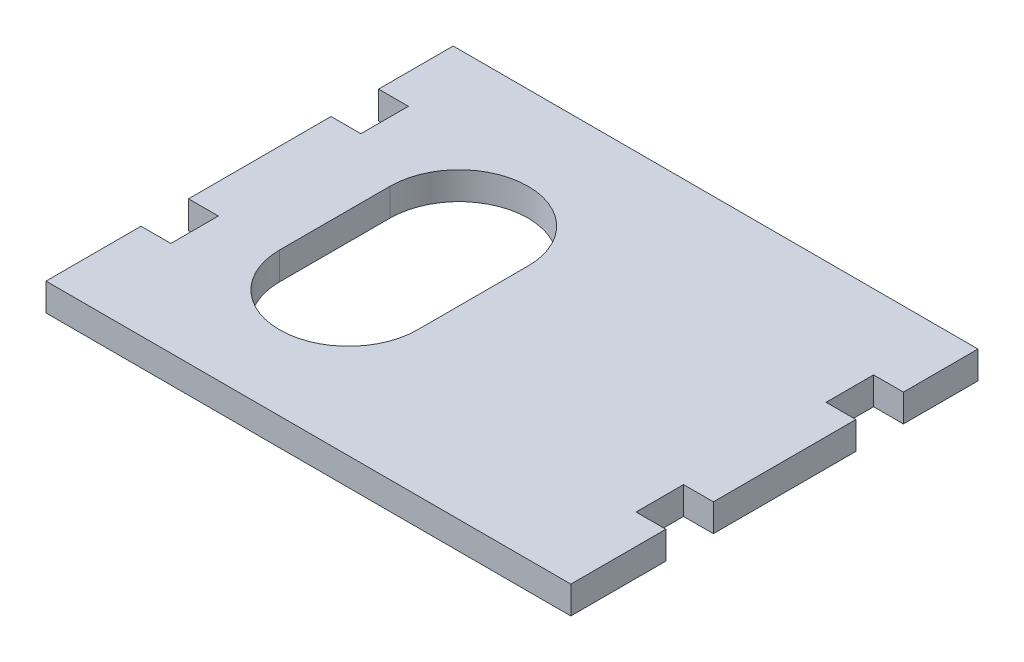
ISO-10303-21;
HEADER;
FILE_DESCRIPTION(('STEP AP214'),'2;1');
FILE_NAME('part.step','',(''),(''),'','','');
FILE_SCHEMA(('AUTOMOTIVE_DESIGN { 1 0 10303 214 1 1 1 1 }'));
ENDSEC;
DATA;
#1=APPLICATION_CONTEXT('core data for automotive mechanical design processes');
#2=APPLICATION_PROTOCOL_DEFINITION('international standard','automotive_design',2000,#1);
#3=PRODUCT_CONTEXT('',#1,'mechanical');
#4=PRODUCT('Part','Part','',(#3));
#5=PRODUCT_RELATED_PRODUCT_CATEGORY('part','',(#4));
#6=PRODUCT_DEFINITION_FORMATION('','',#4);
#7=PRODUCT_DEFINITION_CONTEXT('part definition',#1,'design');
#8=PRODUCT_DEFINITION('design','',#6,#7);
#9=PRODUCT_DEFINITION_SHAPE('','',#8);
#10=(LENGTH_UNIT() NAMED_UNIT(*) SI_UNIT(.MILLI.,.METRE.));
#11=(NAMED_UNIT(*) PLANE_ANGLE_UNIT() SI_UNIT($,.RADIAN.));
#12=(NAMED_UNIT(*) SI_UNIT($,.STERADIAN.) SOLID_ANGLE_UNIT());
#13=UNCERTAINTY_MEASURE_WITH_UNIT(LENGTH_MEASURE(1.E-05),#10,'distance_accuracy_value','');
#14=(GEOMETRIC_REPRESENTATION_CONTEXT(3) GLOBAL_UNCERTAINTY_ASSIGNED_CONTEXT((#13)) GLOBAL_UNIT_ASSIGNED_CONTEXT((#10,
#11,#12)) REPRESENTATION_CONTEXT('',''));
#15=CARTESIAN_POINT('',(0.,0.,0.));
#16=DIRECTION('',(0.,0.,1.));
#17=DIRECTION('',(1.,0.,0.));
#18=AXIS2_PLACEMENT_3D('',#15,#16,#17);
#19=CARTESIAN_POINT('',(50.5504587155964,5.,-24.5126146788991));
#20=DIRECTION('',(1.,0.,0.));
#21=DIRECTION('',(0.,0.,-1.));
#22=AXIS2_PLACEMENT_3D('',#19,#20,#21);
#23=PLANE('',#22);
#24=DIRECTION('',(0.,1.,0.));
#25=VECTOR('',#24,1.);
#26=CARTESIAN_POINT('',(50.5504587155964,-0.00100000000000013,23.3873853211009));
#27=LINE('',#26,#25);
#28=CARTESIAN_POINT('',(50.5504587155964,0.,23.3873853211009));
#29=VERTEX_POINT('',#28);
#30=CARTESIAN_POINT('',(50.5504587155964,5.,23.3873853211009));
#31=VERTEX_POINT('',#30);
#32=EDGE_CURVE('E247',#29,#31,#27,.T.);
#33=ORIENTED_EDGE('',*,*,#32,.F.);
#34=DIRECTION('',(0.,0.,1.));
#35=VECTOR('',#34,1.);
#36=CARTESIAN_POINT('',(50.5504587155964,0.,-24.5126146788991));
#37=LINE('',#36,#35);
#38=CARTESIAN_POINT('',(50.5504587155964,0.,-2.41261467889908));
#39=VERTEX_POINT('',#38);
#40=EDGE_CURVE('E358',#39,#29,#37,.T.);
#41=ORIENTED_EDGE('',*,*,#40,.F.);
#42=DIRECTION('',(0.,1.,0.));
#43=VECTOR('',#42,1.);
#44=CARTESIAN_POINT('',(50.5504587155964,-0.00100000000000013,-2.41261467889908));
#45=LINE('',#44,#43);
#46=CARTESIAN_POINT('',(50.5504587155964,5.,-2.41261467889908));
#47=VERTEX_POINT('',#46);
#48=EDGE_CURVE('E274',#39,#47,#45,.T.);
#49=ORIENTED_EDGE('',*,*,#48,.T.);
#50=DIRECTION('',(0.,0.,1.));
#51=VECTOR('',#50,1.);
#52=CARTESIAN_POINT('',(50.5504587155964,5.,-24.5126146788991));
#53=LINE('',#52,#51);
#54=EDGE_CURVE('E342',#47,#31,#53,.T.);
#55=ORIENTED_EDGE('',*,*,#54,.T.);
#56=EDGE_LOOP('',(#33,#41,#49,#55));
#57=FACE_BOUND('',#56,.T.);
#58=ADVANCED_FACE('F33',(#57),#23,.T.);
#59=DIRECTION('',(0.,1.,0.));
#60=VECTOR('',#59,1.);
#61=CARTESIAN_POINT('',(50.5504587155964,-0.00100000000000013,-11.0126146788991));
#62=LINE('',#61,#60);
#63=CARTESIAN_POINT('',(50.5504587155964,0.,-11.0126146788991));
#64=VERTEX_POINT('',#63);
#65=CARTESIAN_POINT('',(50.5504587155964,5.,-11.0126146788991));
#66=VERTEX_POINT('',#65);
#67=EDGE_CURVE('E272',#64,#66,#62,.T.);
#68=ORIENTED_EDGE('',*,*,#67,.F.);
#69=CARTESIAN_POINT('',(50.5504587155964,0.,-24.5126146788991));
#70=VERTEX_POINT('',#69);
#71=EDGE_CURVE('E354',#70,#64,#37,.T.);
#72=ORIENTED_EDGE('',*,*,#71,.F.);
#73=DIRECTION('',(0.,-1.,0.));
#74=VECTOR('',#73,1.);
#75=CARTESIAN_POINT('',(50.5504587155964,5.,-24.5126146788991));
#76=LINE('',#75,#74);
#77=CARTESIAN_POINT('',(50.5504587155964,5.,-24.5126146788991));
#78=VERTEX_POINT('',#77);
#79=EDGE_CURVE('E362',#78,#70,#76,.T.);
#80=ORIENTED_EDGE('',*,*,#79,.F.);
#81=EDGE_CURVE('E338',#78,#66,#53,.T.);
#82=ORIENTED_EDGE('',*,*,#81,.T.);
#83=EDGE_LOOP('',(#68,#72,#80,#82));
#84=FACE_BOUND('',#83,.T.);
#85=ADVANCED_FACE('F440',(#84),#23,.T.);
#86=CARTESIAN_POINT('',(-44.4495412844036,5.,-24.5126146788991));
#87=DIRECTION('',(1.,0.,0.));
#88=DIRECTION('',(0.,0.,-1.));
#89=AXIS2_PLACEMENT_3D('',#86,#87,#88);
#90=PLANE('',#89);
#91=DIRECTION('',(0.,0.,1.));
#92=VECTOR('',#91,1.);
#93=CARTESIAN_POINT('',(-44.4495412844036,0.,-24.5126146788991));
#94=LINE('',#93,#92);
#95=CARTESIAN_POINT('',(-44.4495412844036,0.,-2.41261467889908));
#96=VERTEX_POINT('',#95);
#97=CARTESIAN_POINT('',(-44.4495412844036,0.,23.3873853211009));
#98=VERTEX_POINT('',#97);
#99=EDGE_CURVE('E350',#96,#98,#94,.T.);
#100=ORIENTED_EDGE('',*,*,#99,.T.);
#101=DIRECTION('',(0.,1.,0.));
#102=VECTOR('',#101,1.);
#103=CARTESIAN_POINT('',(-44.4495412844036,-0.00100000000000013,23.3873853211009));
#104=LINE('',#103,#102);
#105=CARTESIAN_POINT('',(-44.4495412844036,5.,23.3873853211009));
#106=VERTEX_POINT('',#105);
#107=EDGE_CURVE('E294',#98,#106,#104,.T.);
#108=ORIENTED_EDGE('',*,*,#107,.T.);
#109=DIRECTION('',(0.,0.,1.));
#110=VECTOR('',#109,1.);
#111=CARTESIAN_POINT('',(-44.4495412844036,5.,-24.5126146788991));
#112=LINE('',#111,#110);
#113=CARTESIAN_POINT('',(-44.4495412844036,5.,-2.41261467889908));
#114=VERTEX_POINT('',#113);
#115=EDGE_CURVE('E333',#114,#106,#112,.T.);
#116=ORIENTED_EDGE('',*,*,#115,.F.);
#117=DIRECTION('',(0.,1.,0.));
#118=VECTOR('',#117,1.);
#119=CARTESIAN_POINT('',(-44.4495412844036,-0.00100000000000013,-2.41261467889908));
#120=LINE('',#119,#118);
#121=EDGE_CURVE('E317',#96,#114,#120,.T.);
#122=ORIENTED_EDGE('',*,*,#121,.F.);
#123=EDGE_LOOP('',(#100,#108,#116,#122));
#124=FACE_BOUND('',#123,.T.);
#125=ADVANCED_FACE('F407',(#124),#90,.F.);
#126=CARTESIAN_POINT('',(-44.4495412844036,0.,-24.5126146788991));
#127=VERTEX_POINT('',#126);
#128=CARTESIAN_POINT('',(-44.4495412844036,0.,-11.0126146788991));
#129=VERTEX_POINT('',#128);
#130=EDGE_CURVE('E346',#127,#129,#94,.T.);
#131=ORIENTED_EDGE('',*,*,#130,.T.);
#132=DIRECTION('',(0.,1.,0.));
#133=VECTOR('',#132,1.);
#134=CARTESIAN_POINT('',(-44.4495412844036,-0.00100000000000013,-11.0126146788991));
#135=LINE('',#134,#133);
#136=CARTESIAN_POINT('',(-44.4495412844036,5.,-11.0126146788991));
#137=VERTEX_POINT('',#136);
#138=EDGE_CURVE('E318',#129,#137,#135,.T.);
#139=ORIENTED_EDGE('',*,*,#138,.T.);
#140=CARTESIAN_POINT('',(-44.4495412844036,5.,-24.5126146788991));
#141=VERTEX_POINT('',#140);
#142=EDGE_CURVE('E329',#141,#137,#112,.T.);
#143=ORIENTED_EDGE('',*,*,#142,.F.);
#144=DIRECTION('',(0.,-1.,0.));
#145=VECTOR('',#144,1.);
#146=CARTESIAN_POINT('',(-44.4495412844036,5.,-24.5126146788991));
#147=LINE('',#146,#145);
#148=EDGE_CURVE('E345',#141,#127,#147,.T.);
#149=ORIENTED_EDGE('',*,*,#148,.T.);
#150=EDGE_LOOP('',(#131,#139,#143,#149));
#151=FACE_BOUND('',#150,.T.);
#152=ADVANCED_FACE('F431',(#151),#90,.F.);
#153=CARTESIAN_POINT('',(-44.4495412844036,5.,31.9873853211009));
#154=VERTEX_POINT('',#153);
#155=CARTESIAN_POINT('',(-44.4495412844036,5.,49.1873853211009));
#156=VERTEX_POINT('',#155);
#157=EDGE_CURVE('E334',#154,#156,#112,.T.);
#158=ORIENTED_EDGE('',*,*,#157,.F.);
#159=DIRECTION('',(0.,1.,0.));
#160=VECTOR('',#159,1.);
#161=CARTESIAN_POINT('',(-44.4495412844036,-0.00100000000000013,31.9873853211009));
#162=LINE('',#161,#160);
#163=CARTESIAN_POINT('',(-44.4495412844036,0.,31.9873853211009));
#164=VERTEX_POINT('',#163);
#165=EDGE_CURVE('E293',#164,#154,#162,.T.);
#166=ORIENTED_EDGE('',*,*,#165,.F.);
#167=CARTESIAN_POINT('',(-44.4495412844036,0.,49.1873853211009));
#168=VERTEX_POINT('',#167);
#169=EDGE_CURVE('E328',#164,#168,#94,.T.);
#170=ORIENTED_EDGE('',*,*,#169,.T.);
#171=DIRECTION('',(0.,-1.,0.));
#172=VECTOR('',#171,1.);
#173=CARTESIAN_POINT('',(-44.4495412844036,5.,49.1873853211009));
#174=LINE('',#173,#172);
#175=EDGE_CURVE('E11',#156,#168,#174,.T.);
#176=ORIENTED_EDGE('',*,*,#175,.F.);
#177=EDGE_LOOP('',(#158,#166,#170,#176));
#178=FACE_BOUND('',#177,.T.);
#179=ADVANCED_FACE('F35',(#178),#90,.F.);
#180=CARTESIAN_POINT('',(-44.4495412844036,5.,49.1873853211009));
#181=DIRECTION('',(0.,0.,-1.));
#182=DIRECTION('',(-1.,0.,0.));
#183=AXIS2_PLACEMENT_3D('',#180,#181,#182);
#184=PLANE('',#183);
#185=DIRECTION('',(1.,0.,0.));
#186=VECTOR('',#185,1.);
#187=CARTESIAN_POINT('',(-44.4495412844036,0.,49.1873853211009));
#188=LINE('',#187,#186);
#189=CARTESIAN_POINT('',(50.5504587155964,0.,49.1873853211009));
#190=VERTEX_POINT('',#189);
#191=EDGE_CURVE('E349',#168,#190,#188,.T.);
#192=ORIENTED_EDGE('',*,*,#191,.T.);
#193=DIRECTION('',(0.,-1.,0.));
#194=VECTOR('',#193,1.);
#195=CARTESIAN_POINT('',(50.5504587155964,5.,49.1873853211009));
#196=LINE('',#195,#194);
#197=CARTESIAN_POINT('',(50.5504587155964,5.,49.1873853211009));
#198=VERTEX_POINT('',#197);
#199=EDGE_CURVE('E41',#198,#190,#196,.T.);
#200=ORIENTED_EDGE('',*,*,#199,.F.);
#201=DIRECTION('',(1.,0.,0.));
#202=VECTOR('',#201,1.);
#203=CARTESIAN_POINT('',(-44.4495412844036,5.,49.1873853211009));
#204=LINE('',#203,#202);
#205=EDGE_CURVE('E332',#156,#198,#204,.T.);
#206=ORIENTED_EDGE('',*,*,#205,.F.);
#207=ORIENTED_EDGE('',*,*,#175,.T.);
#208=EDGE_LOOP('',(#192,#200,#206,#207));
#209=FACE_BOUND('',#208,.T.);
#210=ADVANCED_FACE('F372',(#209),#184,.F.);
#211=DIRECTION('',(0.,1.,0.));
#212=VECTOR('',#211,1.);
#213=CARTESIAN_POINT('',(50.5504587155964,-0.00100000000000013,31.9873853211009));
#214=LINE('',#213,#212);
#215=CARTESIAN_POINT('',(50.5504587155964,0.,31.9873853211009));
#216=VERTEX_POINT('',#215);
#217=CARTESIAN_POINT('',(50.5504587155964,5.,31.9873853211009));
#218=VERTEX_POINT('',#217);
#219=EDGE_CURVE('E249',#216,#218,#214,.T.);
#220=ORIENTED_EDGE('',*,*,#219,.T.);
#221=EDGE_CURVE('E337',#218,#198,#53,.T.);
#222=ORIENTED_EDGE('',*,*,#221,.T.);
#223=ORIENTED_EDGE('',*,*,#199,.T.);
#224=EDGE_CURVE('E353',#216,#190,#37,.T.);
#225=ORIENTED_EDGE('',*,*,#224,.F.);
#226=EDGE_LOOP('',(#220,#222,#223,#225));
#227=FACE_BOUND('',#226,.T.);
#228=ADVANCED_FACE('F367',(#227),#23,.T.);
#229=CARTESIAN_POINT('',(-44.4495412844036,5.,-24.5126146788991));
#230=DIRECTION('',(0.,0.,-1.));
#231=DIRECTION('',(-1.,0.,0.));
#232=AXIS2_PLACEMENT_3D('',#229,#230,#231);
#233=PLANE('',#232);
#234=DIRECTION('',(1.,0.,0.));
#235=VECTOR('',#234,1.);
#236=CARTESIAN_POINT('',(-44.4495412844036,0.,-24.5126146788991));
#237=LINE('',#236,#235);
#238=EDGE_CURVE('E357',#127,#70,#237,.T.);
#239=ORIENTED_EDGE('',*,*,#238,.F.);
#240=ORIENTED_EDGE('',*,*,#148,.F.);
#241=DIRECTION('',(1.,0.,0.));
#242=VECTOR('',#241,1.);
#243=CARTESIAN_POINT('',(-44.4495412844036,5.,-24.5126146788991));
#244=LINE('',#243,#242);
#245=EDGE_CURVE('E341',#141,#78,#244,.T.);
#246=ORIENTED_EDGE('',*,*,#245,.T.);
#247=ORIENTED_EDGE('',*,*,#79,.T.);
#248=EDGE_LOOP('',(#239,#240,#246,#247));
#249=FACE_BOUND('',#248,.T.);
#250=ADVANCED_FACE('F435',(#249),#233,.T.);
#251=CARTESIAN_POINT('',(0.,5.,0.));
#252=DIRECTION('',(0.,1.,0.));
#253=DIRECTION('',(0.,0.,1.));
#254=AXIS2_PLACEMENT_3D('',#251,#252,#253);
#255=PLANE('',#254);
#256=CARTESIAN_POINT('',(-15.6856392467051,5.,3.18853871329906));
#257=DIRECTION('',(0.,1.,0.));
#258=DIRECTION('',(0.,0.,1.));
#259=AXIS2_PLACEMENT_3D('',#256,#257,#258);
#260=CIRCLE('',#259,12.5);
#261=CARTESIAN_POINT('',(-3.18563924670511,5.,3.18853871329906));
#262=VERTEX_POINT('',#261);
#263=CARTESIAN_POINT('',(-28.1856392467051,5.,3.18853871329906));
#264=VERTEX_POINT('',#263);
#265=EDGE_CURVE('E48',#262,#264,#260,.T.);
#266=ORIENTED_EDGE('',*,*,#265,.F.);
#267=DIRECTION('',(0.,0.,-1.));
#268=VECTOR('',#267,1.);
#269=CARTESIAN_POINT('',(-3.18563924670511,5.,3.18853871329906));
#270=LINE('',#269,#268);
#271=CARTESIAN_POINT('',(-3.18563924670511,5.,23.1885387132991));
#272=VERTEX_POINT('',#271);
#273=EDGE_CURVE('E202',#272,#262,#270,.T.);
#274=ORIENTED_EDGE('',*,*,#273,.F.);
#275=CARTESIAN_POINT('',(-15.6856392467051,5.,23.1885387132991));
#276=DIRECTION('',(0.,1.,0.));
#277=DIRECTION('',(0.,0.,1.));
#278=AXIS2_PLACEMENT_3D('',#275,#276,#277);
#279=CIRCLE('',#278,12.5);
#280=CARTESIAN_POINT('',(-28.1856392467051,5.,23.1885387132991));
#281=VERTEX_POINT('',#280);
#282=EDGE_CURVE('E222',#281,#272,#279,.T.);
#283=ORIENTED_EDGE('',*,*,#282,.F.);
#284=DIRECTION('',(0.,0.,1.));
#285=VECTOR('',#284,1.);
#286=CARTESIAN_POINT('',(-28.1856392467051,5.,3.18853871329906));
#287=LINE('',#286,#285);
#288=EDGE_CURVE('E216',#264,#281,#287,.T.);
#289=ORIENTED_EDGE('',*,*,#288,.F.);
#290=EDGE_LOOP('',(#266,#274,#283,#289));
#291=FACE_BOUND('',#290,.T.);
#292=DIRECTION('',(-1.,0.,0.));
#293=VECTOR('',#292,1.);
#294=CARTESIAN_POINT('',(45.1504587155964,5.,23.3873853211009));
#295=LINE('',#294,#293);
#296=CARTESIAN_POINT('',(45.1504587155964,5.,23.3873853211009));
#297=VERTEX_POINT('',#296);
#298=EDGE_CURVE('E240',#31,#297,#295,.T.);
#299=ORIENTED_EDGE('',*,*,#298,.F.);
#300=ORIENTED_EDGE('',*,*,#54,.F.);
#301=DIRECTION('',(1.,0.,0.));
#302=VECTOR('',#301,1.);
#303=CARTESIAN_POINT('',(45.1504587155964,5.,-2.41261467889908));
#304=LINE('',#303,#302);
#305=CARTESIAN_POINT('',(45.1504587155964,5.,-2.41261467889908));
#306=VERTEX_POINT('',#305);
#307=EDGE_CURVE('E263',#306,#47,#304,.T.);
#308=ORIENTED_EDGE('',*,*,#307,.F.);
#309=DIRECTION('',(0.,0.,1.));
#310=VECTOR('',#309,1.);
#311=CARTESIAN_POINT('',(45.1504587155964,5.,-11.0126146788991));
#312=LINE('',#311,#310);
#313=CARTESIAN_POINT('',(45.1504587155964,5.,-11.0126146788991));
#314=VERTEX_POINT('',#313);
#315=EDGE_CURVE('E260',#314,#306,#312,.T.);
#316=ORIENTED_EDGE('',*,*,#315,.F.);
#317=DIRECTION('',(-1.,0.,0.));
#318=VECTOR('',#317,1.);
#319=CARTESIAN_POINT('',(45.1504587155964,5.,-11.0126146788991));
#320=LINE('',#319,#318);
#321=EDGE_CURVE('E265',#66,#314,#320,.T.);
#322=ORIENTED_EDGE('',*,*,#321,.F.);
#323=ORIENTED_EDGE('',*,*,#81,.F.);
#324=ORIENTED_EDGE('',*,*,#245,.F.);
#325=ORIENTED_EDGE('',*,*,#142,.T.);
#326=DIRECTION('',(-1.,0.,0.));
#327=VECTOR('',#326,1.);
#328=CARTESIAN_POINT('',(-44.4495412844036,5.,-11.0126146788991));
#329=LINE('',#328,#327);
#330=CARTESIAN_POINT('',(-39.0495412844036,5.,-11.0126146788991));
#331=VERTEX_POINT('',#330);
#332=EDGE_CURVE('E315',#331,#137,#329,.T.);
#333=ORIENTED_EDGE('',*,*,#332,.F.);
#334=DIRECTION('',(0.,0.,-1.));
#335=VECTOR('',#334,1.);
#336=CARTESIAN_POINT('',(-39.0495412844036,5.,-11.0126146788991));
#337=LINE('',#336,#335);
#338=CARTESIAN_POINT('',(-39.0495412844036,5.,-2.41261467889908));
#339=VERTEX_POINT('',#338);
#340=EDGE_CURVE('E312',#339,#331,#337,.T.);
#341=ORIENTED_EDGE('',*,*,#340,.F.);
#342=DIRECTION('',(1.,0.,0.));
#343=VECTOR('',#342,1.);
#344=CARTESIAN_POINT('',(-44.4495412844036,5.,-2.41261467889908));
#345=LINE('',#344,#343);
#346=EDGE_CURVE('E309',#114,#339,#345,.T.);
#347=ORIENTED_EDGE('',*,*,#346,.F.);
#348=ORIENTED_EDGE('',*,*,#115,.T.);
#349=DIRECTION('',(-1.,0.,0.));
#350=VECTOR('',#349,1.);
#351=CARTESIAN_POINT('',(-44.4495412844036,5.,23.3873853211009));
#352=LINE('',#351,#350);
#353=CARTESIAN_POINT('',(-39.0495412844036,5.,23.3873853211009));
#354=VERTEX_POINT('',#353);
#355=EDGE_CURVE('E291',#354,#106,#352,.T.);
#356=ORIENTED_EDGE('',*,*,#355,.F.);
#357=DIRECTION('',(0.,0.,-1.));
#358=VECTOR('',#357,1.);
#359=CARTESIAN_POINT('',(-39.0495412844036,5.,23.3873853211009));
#360=LINE('',#359,#358);
#361=CARTESIAN_POINT('',(-39.0495412844036,5.,31.9873853211009));
#362=VERTEX_POINT('',#361);
#363=EDGE_CURVE('E288',#362,#354,#360,.T.);
#364=ORIENTED_EDGE('',*,*,#363,.F.);
#365=DIRECTION('',(1.,0.,0.));
#366=VECTOR('',#365,1.);
#367=CARTESIAN_POINT('',(-44.4495412844036,5.,31.9873853211009));
#368=LINE('',#367,#366);
#369=EDGE_CURVE('E285',#154,#362,#368,.T.);
#370=ORIENTED_EDGE('',*,*,#369,.F.);
#371=ORIENTED_EDGE('',*,*,#157,.T.);
#372=ORIENTED_EDGE('',*,*,#205,.T.);
#373=ORIENTED_EDGE('',*,*,#221,.F.);
#374=DIRECTION('',(1.,0.,0.));
#375=VECTOR('',#374,1.);
#376=CARTESIAN_POINT('',(45.1504587155964,5.,31.9873853211009));
#377=LINE('',#376,#375);
#378=CARTESIAN_POINT('',(45.1504587155964,5.,31.9873853211009));
#379=VERTEX_POINT('',#378);
#380=EDGE_CURVE('E238',#379,#218,#377,.T.);
#381=ORIENTED_EDGE('',*,*,#380,.F.);
#382=DIRECTION('',(0.,0.,1.));
#383=VECTOR('',#382,1.);
#384=CARTESIAN_POINT('',(45.1504587155964,5.,23.3873853211009));
#385=LINE('',#384,#383);
#386=EDGE_CURVE('E235',#297,#379,#385,.T.);
#387=ORIENTED_EDGE('',*,*,#386,.F.);
#388=EDGE_LOOP('',(#299,#300,#308,#316,#322,#323,#324,#325,#333,#341,#347,#348,#356,#364,#370,
#371,#372,#373,#381,#387));
#389=FACE_BOUND('',#388,.T.);
#390=ADVANCED_FACE('F392',(#291,#389),#255,.T.);
#391=CARTESIAN_POINT('',(0.,0.,0.));
#392=DIRECTION('',(0.,1.,0.));
#393=DIRECTION('',(0.,0.,1.));
#394=AXIS2_PLACEMENT_3D('',#391,#392,#393);
#395=PLANE('',#394);
#396=DIRECTION('',(0.,0.,1.));
#397=VECTOR('',#396,1.);
#398=CARTESIAN_POINT('',(-3.18563924670511,0.,3.18853871329906));
#399=LINE('',#398,#397);
#400=CARTESIAN_POINT('',(-3.18563924670511,0.,3.18853871329906));
#401=VERTEX_POINT('',#400);
#402=CARTESIAN_POINT('',(-3.18563924670511,0.,23.1885387132991));
#403=VERTEX_POINT('',#402);
#404=EDGE_CURVE('E214',#401,#403,#399,.T.);
#405=ORIENTED_EDGE('',*,*,#404,.F.);
#406=CARTESIAN_POINT('',(-15.6856392467051,0.,3.18853871329906));
#407=DIRECTION('',(0.,1.,0.));
#408=DIRECTION('',(0.,0.,1.));
#409=AXIS2_PLACEMENT_3D('',#406,#407,#408);
#410=CIRCLE('',#409,12.5);
#411=CARTESIAN_POINT('',(-28.1856392467051,0.,3.18853871329906));
#412=VERTEX_POINT('',#411);
#413=EDGE_CURVE('E196',#412,#401,#410,.F.);
#414=ORIENTED_EDGE('',*,*,#413,.F.);
#415=DIRECTION('',(0.,0.,-1.));
#416=VECTOR('',#415,1.);
#417=CARTESIAN_POINT('',(-28.1856392467051,0.,3.18853871329906));
#418=LINE('',#417,#416);
#419=CARTESIAN_POINT('',(-28.1856392467051,0.,23.1885387132991));
#420=VERTEX_POINT('',#419);
#421=EDGE_CURVE('E205',#420,#412,#418,.T.);
#422=ORIENTED_EDGE('',*,*,#421,.F.);
#423=CARTESIAN_POINT('',(-15.6856392467051,0.,23.1885387132991));
#424=DIRECTION('',(0.,1.,0.));
#425=DIRECTION('',(0.,0.,1.));
#426=AXIS2_PLACEMENT_3D('',#423,#424,#425);
#427=CIRCLE('',#426,12.5);
#428=EDGE_CURVE('E56',#403,#420,#427,.F.);
#429=ORIENTED_EDGE('',*,*,#428,.F.);
#430=EDGE_LOOP('',(#405,#414,#422,#429));
#431=FACE_BOUND('',#430,.T.);
#432=ORIENTED_EDGE('',*,*,#40,.T.);
#433=DIRECTION('',(1.,0.,0.));
#434=VECTOR('',#433,1.);
#435=CARTESIAN_POINT('',(45.1504587155964,0.,23.3873853211009));
#436=LINE('',#435,#434);
#437=CARTESIAN_POINT('',(45.1504587155964,0.,23.3873853211009));
#438=VERTEX_POINT('',#437);
#439=EDGE_CURVE('E233',#438,#29,#436,.T.);
#440=ORIENTED_EDGE('',*,*,#439,.F.);
#441=DIRECTION('',(0.,0.,-1.));
#442=VECTOR('',#441,1.);
#443=CARTESIAN_POINT('',(45.1504587155964,0.,23.3873853211009));
#444=LINE('',#443,#442);
#445=CARTESIAN_POINT('',(45.1504587155964,0.,31.9873853211009));
#446=VERTEX_POINT('',#445);
#447=EDGE_CURVE('E208',#446,#438,#444,.T.);
#448=ORIENTED_EDGE('',*,*,#447,.F.);
#449=DIRECTION('',(-1.,0.,0.));
#450=VECTOR('',#449,1.);
#451=CARTESIAN_POINT('',(45.1504587155964,0.,31.9873853211009));
#452=LINE('',#451,#450);
#453=EDGE_CURVE('E246',#216,#446,#452,.T.);
#454=ORIENTED_EDGE('',*,*,#453,.F.);
#455=ORIENTED_EDGE('',*,*,#224,.T.);
#456=ORIENTED_EDGE('',*,*,#191,.F.);
#457=ORIENTED_EDGE('',*,*,#169,.F.);
#458=DIRECTION('',(-1.,0.,0.));
#459=VECTOR('',#458,1.);
#460=CARTESIAN_POINT('',(-44.4495412844036,0.,31.9873853211009));
#461=LINE('',#460,#459);
#462=CARTESIAN_POINT('',(-39.0495412844036,0.,31.9873853211009));
#463=VERTEX_POINT('',#462);
#464=EDGE_CURVE('E297',#463,#164,#461,.T.);
#465=ORIENTED_EDGE('',*,*,#464,.F.);
#466=DIRECTION('',(0.,0.,1.));
#467=VECTOR('',#466,1.);
#468=CARTESIAN_POINT('',(-39.0495412844036,0.,23.3873853211009));
#469=LINE('',#468,#467);
#470=CARTESIAN_POINT('',(-39.0495412844036,0.,23.3873853211009));
#471=VERTEX_POINT('',#470);
#472=EDGE_CURVE('E280',#471,#463,#469,.T.);
#473=ORIENTED_EDGE('',*,*,#472,.F.);
#474=DIRECTION('',(1.,0.,0.));
#475=VECTOR('',#474,1.);
#476=CARTESIAN_POINT('',(-44.4495412844036,0.,23.3873853211009));
#477=LINE('',#476,#475);
#478=EDGE_CURVE('E282',#98,#471,#477,.T.);
#479=ORIENTED_EDGE('',*,*,#478,.F.);
#480=ORIENTED_EDGE('',*,*,#99,.F.);
#481=DIRECTION('',(-1.,0.,0.));
#482=VECTOR('',#481,1.);
#483=CARTESIAN_POINT('',(-44.4495412844036,0.,-2.41261467889908));
#484=LINE('',#483,#482);
#485=CARTESIAN_POINT('',(-39.0495412844036,0.,-2.41261467889908));
#486=VERTEX_POINT('',#485);
#487=EDGE_CURVE('E321',#486,#96,#484,.T.);
#488=ORIENTED_EDGE('',*,*,#487,.F.);
#489=DIRECTION('',(0.,0.,1.));
#490=VECTOR('',#489,1.);
#491=CARTESIAN_POINT('',(-39.0495412844036,0.,-11.0126146788991));
#492=LINE('',#491,#490);
#493=CARTESIAN_POINT('',(-39.0495412844036,0.,-11.0126146788991));
#494=VERTEX_POINT('',#493);
#495=EDGE_CURVE('E304',#494,#486,#492,.T.);
#496=ORIENTED_EDGE('',*,*,#495,.F.);
#497=DIRECTION('',(1.,0.,0.));
#498=VECTOR('',#497,1.);
#499=CARTESIAN_POINT('',(-44.4495412844036,0.,-11.0126146788991));
#500=LINE('',#499,#498);
#501=EDGE_CURVE('E306',#129,#494,#500,.T.);
#502=ORIENTED_EDGE('',*,*,#501,.F.);
#503=ORIENTED_EDGE('',*,*,#130,.F.);
#504=ORIENTED_EDGE('',*,*,#238,.T.);
#505=ORIENTED_EDGE('',*,*,#71,.T.);
#506=DIRECTION('',(1.,0.,0.));
#507=VECTOR('',#506,1.);
#508=CARTESIAN_POINT('',(45.1504587155964,0.,-11.0126146788991));
#509=LINE('',#508,#507);
#510=CARTESIAN_POINT('',(45.1504587155964,0.,-11.0126146788991));
#511=VERTEX_POINT('',#510);
#512=EDGE_CURVE('E258',#511,#64,#509,.T.);
#513=ORIENTED_EDGE('',*,*,#512,.F.);
#514=DIRECTION('',(0.,0.,-1.));
#515=VECTOR('',#514,1.);
#516=CARTESIAN_POINT('',(45.1504587155964,0.,-11.0126146788991));
#517=LINE('',#516,#515);
#518=CARTESIAN_POINT('',(45.1504587155964,0.,-2.41261467889908));
#519=VERTEX_POINT('',#518);
#520=EDGE_CURVE('E255',#519,#511,#517,.T.);
#521=ORIENTED_EDGE('',*,*,#520,.F.);
#522=DIRECTION('',(-1.,0.,0.));
#523=VECTOR('',#522,1.);
#524=CARTESIAN_POINT('',(45.1504587155964,0.,-2.41261467889908));
#525=LINE('',#524,#523);
#526=EDGE_CURVE('E271',#39,#519,#525,.T.);
#527=ORIENTED_EDGE('',*,*,#526,.F.);
#528=EDGE_LOOP('',(#432,#440,#448,#454,#455,#456,#457,#465,#473,#479,#480,#488,#496,#502,#503,
#504,#505,#513,#521,#527));
#529=FACE_BOUND('',#528,.T.);
#530=ADVANCED_FACE('F211',(#431,#529),#395,.F.);
#531=CARTESIAN_POINT('',(-44.4495412844036,-0.00100000000000013,-11.0126146788991));
#532=DIRECTION('',(0.,0.,-1.));
#533=DIRECTION('',(-1.,0.,0.));
#534=AXIS2_PLACEMENT_3D('',#531,#532,#533);
#535=PLANE('',#534);
#536=ORIENTED_EDGE('',*,*,#501,.T.);
#537=DIRECTION('',(0.,1.,0.));
#538=VECTOR('',#537,1.);
#539=CARTESIAN_POINT('',(-39.0495412844036,-0.00100000000000013,-11.0126146788991));
#540=LINE('',#539,#538);
#541=EDGE_CURVE('E322',#494,#331,#540,.T.);
#542=ORIENTED_EDGE('',*,*,#541,.T.);
#543=ORIENTED_EDGE('',*,*,#332,.T.);
#544=ORIENTED_EDGE('',*,*,#138,.F.);
#545=EDGE_LOOP('',(#536,#542,#543,#544));
#546=FACE_BOUND('',#545,.T.);
#547=ADVANCED_FACE('F498',(#546),#535,.F.);
#548=CARTESIAN_POINT('',(-39.0495412844036,-0.00100000000000013,-11.0126146788991));
#549=DIRECTION('',(1.,0.,0.));
#550=DIRECTION('',(0.,0.,-1.));
#551=AXIS2_PLACEMENT_3D('',#548,#549,#550);
#552=PLANE('',#551);
#553=ORIENTED_EDGE('',*,*,#495,.T.);
#554=DIRECTION('',(0.,1.,0.));
#555=VECTOR('',#554,1.);
#556=CARTESIAN_POINT('',(-39.0495412844036,-0.00100000000000013,-2.41261467889908));
#557=LINE('',#556,#555);
#558=EDGE_CURVE('E324',#486,#339,#557,.T.);
#559=ORIENTED_EDGE('',*,*,#558,.T.);
#560=ORIENTED_EDGE('',*,*,#340,.T.);
#561=ORIENTED_EDGE('',*,*,#541,.F.);
#562=EDGE_LOOP('',(#553,#559,#560,#561));
#563=FACE_BOUND('',#562,.T.);
#564=ADVANCED_FACE('F425',(#563),#552,.F.);
#565=CARTESIAN_POINT('',(-44.4495412844036,-0.00100000000000013,-2.41261467889908));
#566=DIRECTION('',(0.,0.,1.));
#567=DIRECTION('',(1.,0.,0.));
#568=AXIS2_PLACEMENT_3D('',#565,#566,#567);
#569=PLANE('',#568);
#570=ORIENTED_EDGE('',*,*,#487,.T.);
#571=ORIENTED_EDGE('',*,*,#121,.T.);
#572=ORIENTED_EDGE('',*,*,#346,.T.);
#573=ORIENTED_EDGE('',*,*,#558,.F.);
#574=EDGE_LOOP('',(#570,#571,#572,#573));
#575=FACE_BOUND('',#574,.T.);
#576=ADVANCED_FACE('F423',(#575),#569,.F.);
#577=CARTESIAN_POINT('',(-44.4495412844036,-0.00100000000000013,23.3873853211009));
#578=DIRECTION('',(0.,0.,-1.));
#579=DIRECTION('',(-1.,0.,0.));
#580=AXIS2_PLACEMENT_3D('',#577,#578,#579);
#581=PLANE('',#580);
#582=ORIENTED_EDGE('',*,*,#478,.T.);
#583=DIRECTION('',(0.,1.,0.));
#584=VECTOR('',#583,1.);
#585=CARTESIAN_POINT('',(-39.0495412844036,-0.00100000000000013,23.3873853211009));
#586=LINE('',#585,#584);
#587=EDGE_CURVE('E298',#471,#354,#586,.T.);
#588=ORIENTED_EDGE('',*,*,#587,.T.);
#589=ORIENTED_EDGE('',*,*,#355,.T.);
#590=ORIENTED_EDGE('',*,*,#107,.F.);
#591=EDGE_LOOP('',(#582,#588,#589,#590));
#592=FACE_BOUND('',#591,.T.);
#593=ADVANCED_FACE('F415',(#592),#581,.F.);
#594=CARTESIAN_POINT('',(-39.0495412844036,-0.00100000000000013,23.3873853211009));
#595=DIRECTION('',(1.,0.,0.));
#596=DIRECTION('',(0.,0.,-1.));
#597=AXIS2_PLACEMENT_3D('',#594,#595,#596);
#598=PLANE('',#597);
#599=ORIENTED_EDGE('',*,*,#472,.T.);
#600=DIRECTION('',(0.,1.,0.));
#601=VECTOR('',#600,1.);
#602=CARTESIAN_POINT('',(-39.0495412844036,-0.00100000000000013,31.9873853211009));
#603=LINE('',#602,#601);
#604=EDGE_CURVE('E300',#463,#362,#603,.T.);
#605=ORIENTED_EDGE('',*,*,#604,.T.);
#606=ORIENTED_EDGE('',*,*,#363,.T.);
#607=ORIENTED_EDGE('',*,*,#587,.F.);
#608=EDGE_LOOP('',(#599,#605,#606,#607));
#609=FACE_BOUND('',#608,.T.);
#610=ADVANCED_FACE('F603',(#609),#598,.F.);
#611=CARTESIAN_POINT('',(-44.4495412844036,-0.00100000000000013,31.9873853211009));
#612=DIRECTION('',(0.,0.,1.));
#613=DIRECTION('',(1.,0.,0.));
#614=AXIS2_PLACEMENT_3D('',#611,#612,#613);
#615=PLANE('',#614);
#616=ORIENTED_EDGE('',*,*,#464,.T.);
#617=ORIENTED_EDGE('',*,*,#165,.T.);
#618=ORIENTED_EDGE('',*,*,#369,.T.);
#619=ORIENTED_EDGE('',*,*,#604,.F.);
#620=EDGE_LOOP('',(#616,#617,#618,#619));
#621=FACE_BOUND('',#620,.T.);
#622=ADVANCED_FACE('F595',(#621),#615,.F.);
#623=CARTESIAN_POINT('',(45.1504587155964,-0.00100000000000013,-11.0126146788991));
#624=DIRECTION('',(-1.,0.,0.));
#625=DIRECTION('',(0.,0.,1.));
#626=AXIS2_PLACEMENT_3D('',#623,#624,#625);
#627=PLANE('',#626);
#628=ORIENTED_EDGE('',*,*,#520,.T.);
#629=DIRECTION('',(0.,1.,0.));
#630=VECTOR('',#629,1.);
#631=CARTESIAN_POINT('',(45.1504587155964,-0.00100000000000013,-11.0126146788991));
#632=LINE('',#631,#630);
#633=EDGE_CURVE('E269',#511,#314,#632,.T.);
#634=ORIENTED_EDGE('',*,*,#633,.T.);
#635=ORIENTED_EDGE('',*,*,#315,.T.);
#636=DIRECTION('',(0.,1.,0.));
#637=VECTOR('',#636,1.);
#638=CARTESIAN_POINT('',(45.1504587155964,-0.00100000000000013,-2.41261467889908));
#639=LINE('',#638,#637);
#640=EDGE_CURVE('E268',#519,#306,#639,.T.);
#641=ORIENTED_EDGE('',*,*,#640,.F.);
#642=EDGE_LOOP('',(#628,#634,#635,#641));
#643=FACE_BOUND('',#642,.T.);
#644=ADVANCED_FACE('F447',(#643),#627,.F.);
#645=CARTESIAN_POINT('',(45.1504587155964,-0.00100000000000013,-11.0126146788991));
#646=DIRECTION('',(0.,0.,-1.));
#647=DIRECTION('',(-1.,0.,0.));
#648=AXIS2_PLACEMENT_3D('',#645,#646,#647);
#649=PLANE('',#648);
#650=ORIENTED_EDGE('',*,*,#512,.T.);
#651=ORIENTED_EDGE('',*,*,#67,.T.);
#652=ORIENTED_EDGE('',*,*,#321,.T.);
#653=ORIENTED_EDGE('',*,*,#633,.F.);
#654=EDGE_LOOP('',(#650,#651,#652,#653));
#655=FACE_BOUND('',#654,.T.);
#656=ADVANCED_FACE('F444',(#655),#649,.F.);
#657=CARTESIAN_POINT('',(45.1504587155964,-0.00100000000000013,-2.41261467889908));
#658=DIRECTION('',(0.,0.,1.));
#659=DIRECTION('',(1.,0.,0.));
#660=AXIS2_PLACEMENT_3D('',#657,#658,#659);
#661=PLANE('',#660);
#662=ORIENTED_EDGE('',*,*,#526,.T.);
#663=ORIENTED_EDGE('',*,*,#640,.T.);
#664=ORIENTED_EDGE('',*,*,#307,.T.);
#665=ORIENTED_EDGE('',*,*,#48,.F.);
#666=EDGE_LOOP('',(#662,#663,#664,#665));
#667=FACE_BOUND('',#666,.T.);
#668=ADVANCED_FACE('F449',(#667),#661,.F.);
#669=CARTESIAN_POINT('',(45.1504587155964,-0.00100000000000013,23.3873853211009));
#670=DIRECTION('',(-1.,0.,0.));
#671=DIRECTION('',(0.,0.,1.));
#672=AXIS2_PLACEMENT_3D('',#669,#670,#671);
#673=PLANE('',#672);
#674=ORIENTED_EDGE('',*,*,#447,.T.);
#675=DIRECTION('',(0.,1.,0.));
#676=VECTOR('',#675,1.);
#677=CARTESIAN_POINT('',(45.1504587155964,-0.00100000000000013,23.3873853211009));
#678=LINE('',#677,#676);
#679=EDGE_CURVE('E244',#438,#297,#678,.T.);
#680=ORIENTED_EDGE('',*,*,#679,.T.);
#681=ORIENTED_EDGE('',*,*,#386,.T.);
#682=DIRECTION('',(0.,1.,0.));
#683=VECTOR('',#682,1.);
#684=CARTESIAN_POINT('',(45.1504587155964,-0.00100000000000013,31.9873853211009));
#685=LINE('',#684,#683);
#686=EDGE_CURVE('E243',#446,#379,#685,.T.);
#687=ORIENTED_EDGE('',*,*,#686,.F.);
#688=EDGE_LOOP('',(#674,#680,#681,#687));
#689=FACE_BOUND('',#688,.T.);
#690=ADVANCED_FACE('F396',(#689),#673,.F.);
#691=CARTESIAN_POINT('',(45.1504587155964,-0.00100000000000013,23.3873853211009));
#692=DIRECTION('',(0.,0.,-1.));
#693=DIRECTION('',(-1.,0.,0.));
#694=AXIS2_PLACEMENT_3D('',#691,#692,#693);
#695=PLANE('',#694);
#696=ORIENTED_EDGE('',*,*,#439,.T.);
#697=ORIENTED_EDGE('',*,*,#32,.T.);
#698=ORIENTED_EDGE('',*,*,#298,.T.);
#699=ORIENTED_EDGE('',*,*,#679,.F.);
#700=EDGE_LOOP('',(#696,#697,#698,#699));
#701=FACE_BOUND('',#700,.T.);
#702=ADVANCED_FACE('F389',(#701),#695,.F.);
#703=CARTESIAN_POINT('',(45.1504587155964,-0.00100000000000013,31.9873853211009));
#704=DIRECTION('',(0.,0.,1.));
#705=DIRECTION('',(1.,0.,0.));
#706=AXIS2_PLACEMENT_3D('',#703,#704,#705);
#707=PLANE('',#706);
#708=ORIENTED_EDGE('',*,*,#453,.T.);
#709=ORIENTED_EDGE('',*,*,#686,.T.);
#710=ORIENTED_EDGE('',*,*,#380,.T.);
#711=ORIENTED_EDGE('',*,*,#219,.F.);
#712=EDGE_LOOP('',(#708,#709,#710,#711));
#713=FACE_BOUND('',#712,.T.);
#714=ADVANCED_FACE('F398',(#713),#707,.F.);
#715=CARTESIAN_POINT('',(-15.6856392467051,-0.00100000000000013,3.18853871329906));
#716=DIRECTION('',(0.,1.,0.));
#717=DIRECTION('',(0.,0.,1.));
#718=AXIS2_PLACEMENT_3D('',#715,#716,#717);
#719=CYLINDRICAL_SURFACE('',#718,12.5);
#720=ORIENTED_EDGE('',*,*,#413,.T.);
#721=DIRECTION('',(0.,1.,0.));
#722=VECTOR('',#721,1.);
#723=CARTESIAN_POINT('',(-3.18563924670511,-0.00100000000000013,3.18853871329906));
#724=LINE('',#723,#722);
#725=EDGE_CURVE('E209',#401,#262,#724,.T.);
#726=ORIENTED_EDGE('',*,*,#725,.T.);
#727=ORIENTED_EDGE('',*,*,#265,.T.);
#728=DIRECTION('',(0.,1.,0.));
#729=VECTOR('',#728,1.);
#730=CARTESIAN_POINT('',(-28.1856392467051,-0.00100000000000013,3.18853871329906));
#731=LINE('',#730,#729);
#732=EDGE_CURVE('E192',#412,#264,#731,.T.);
#733=ORIENTED_EDGE('',*,*,#732,.F.);
#734=EDGE_LOOP('',(#720,#726,#727,#733));
#735=FACE_BOUND('',#734,.T.);
#736=ADVANCED_FACE('F194',(#735),#719,.F.);
#737=CARTESIAN_POINT('',(-3.18563924670511,-0.00100000000000013,3.18853871329906));
#738=DIRECTION('',(1.,0.,0.));
#739=DIRECTION('',(0.,0.,-1.));
#740=AXIS2_PLACEMENT_3D('',#737,#738,#739);
#741=PLANE('',#740);
#742=ORIENTED_EDGE('',*,*,#404,.T.);
#743=DIRECTION('',(0.,1.,0.));
#744=VECTOR('',#743,1.);
#745=CARTESIAN_POINT('',(-3.18563924670511,-0.00100000000000013,23.1885387132991));
#746=LINE('',#745,#744);
#747=EDGE_CURVE('E228',#403,#272,#746,.T.);
#748=ORIENTED_EDGE('',*,*,#747,.T.);
#749=ORIENTED_EDGE('',*,*,#273,.T.);
#750=ORIENTED_EDGE('',*,*,#725,.F.);
#751=EDGE_LOOP('',(#742,#748,#749,#750));
#752=FACE_BOUND('',#751,.T.);
#753=ADVANCED_FACE('F537',(#752),#741,.F.);
#754=CARTESIAN_POINT('',(-15.6856392467051,-0.00100000000000013,23.1885387132991));
#755=DIRECTION('',(0.,1.,0.));
#756=DIRECTION('',(0.,0.,1.));
#757=AXIS2_PLACEMENT_3D('',#754,#755,#756);
#758=CYLINDRICAL_SURFACE('',#757,12.5);
#759=ORIENTED_EDGE('',*,*,#428,.T.);
#760=DIRECTION('',(0.,1.,0.));
#761=VECTOR('',#760,1.);
#762=CARTESIAN_POINT('',(-28.1856392467051,-0.00100000000000013,23.1885387132991));
#763=LINE('',#762,#761);
#764=EDGE_CURVE('E201',#420,#281,#763,.T.);
#765=ORIENTED_EDGE('',*,*,#764,.T.);
#766=ORIENTED_EDGE('',*,*,#282,.T.);
#767=ORIENTED_EDGE('',*,*,#747,.F.);
#768=EDGE_LOOP('',(#759,#765,#766,#767));
#769=FACE_BOUND('',#768,.T.);
#770=ADVANCED_FACE('F546',(#769),#758,.F.);
#771=CARTESIAN_POINT('',(-28.1856392467051,-0.00100000000000013,3.18853871329906));
#772=DIRECTION('',(-1.,0.,0.));
#773=DIRECTION('',(0.,0.,1.));
#774=AXIS2_PLACEMENT_3D('',#771,#772,#773);
#775=PLANE('',#774);
#776=ORIENTED_EDGE('',*,*,#421,.T.);
#777=ORIENTED_EDGE('',*,*,#732,.T.);
#778=ORIENTED_EDGE('',*,*,#288,.T.);
#779=ORIENTED_EDGE('',*,*,#764,.F.);
#780=EDGE_LOOP('',(#776,#777,#778,#779));
#781=FACE_BOUND('',#780,.T.);
#782=ADVANCED_FACE('F206',(#781),#775,.F.);
#783=CLOSED_SHELL('',(#58,#85,#125,#152,#179,#210,#228,#250,#390,#530,#547,#564,#576,#593,#610,
#622,#644,#656,#668,#690,#702,#714,#736,#753,#770,#782));
#784=MANIFOLD_SOLID_BREP('B2',#783);
#785=ADVANCED_BREP_SHAPE_REPRESENTATION('',(#18,#784),#14);
#786=SHAPE_DEFINITION_REPRESENTATION(#9,#785);
ENDSEC;
END-ISO-10303-21;
